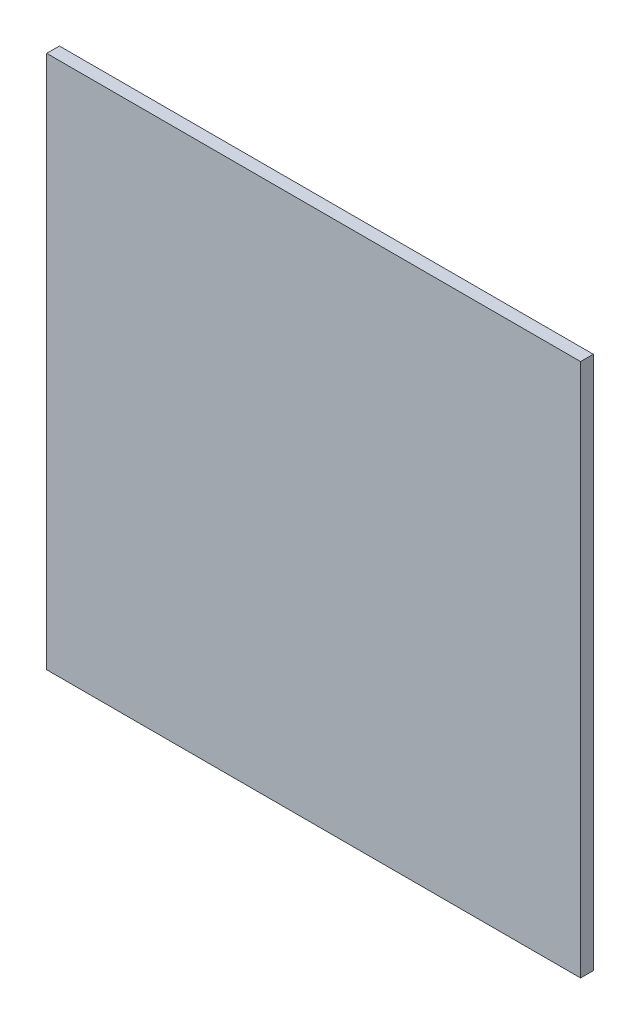
ISO-10303-21;
HEADER;
FILE_DESCRIPTION(('STEP AP214'),'2;1');
FILE_NAME('part.step','',(''),(''),'','','');
FILE_SCHEMA(('AUTOMOTIVE_DESIGN { 1 0 10303 214 1 1 1 1 }'));
ENDSEC;
DATA;
#1=APPLICATION_CONTEXT('core data for automotive mechanical design processes');
#2=APPLICATION_PROTOCOL_DEFINITION('international standard','automotive_design',2000,#1);
#3=PRODUCT_CONTEXT('',#1,'mechanical');
#4=PRODUCT('Part','Part','',(#3));
#5=PRODUCT_RELATED_PRODUCT_CATEGORY('part','',(#4));
#6=PRODUCT_DEFINITION_FORMATION('','',#4);
#7=PRODUCT_DEFINITION_CONTEXT('part definition',#1,'design');
#8=PRODUCT_DEFINITION('design','',#6,#7);
#9=PRODUCT_DEFINITION_SHAPE('','',#8);
#10=(LENGTH_UNIT() NAMED_UNIT(*) SI_UNIT(.MILLI.,.METRE.));
#11=(NAMED_UNIT(*) PLANE_ANGLE_UNIT() SI_UNIT($,.RADIAN.));
#12=(NAMED_UNIT(*) SI_UNIT($,.STERADIAN.) SOLID_ANGLE_UNIT());
#13=UNCERTAINTY_MEASURE_WITH_UNIT(LENGTH_MEASURE(1.E-05),#10,'distance_accuracy_value','');
#14=(GEOMETRIC_REPRESENTATION_CONTEXT(3) GLOBAL_UNCERTAINTY_ASSIGNED_CONTEXT((#13)) GLOBAL_UNIT_ASSIGNED_CONTEXT((#10,
#11,#12)) REPRESENTATION_CONTEXT('',''));
#15=CARTESIAN_POINT('',(0.,0.,0.));
#16=DIRECTION('',(0.,0.,1.));
#17=DIRECTION('',(1.,0.,0.));
#18=AXIS2_PLACEMENT_3D('',#15,#16,#17);
#19=CARTESIAN_POINT('',(133.35,-133.35,6.35));
#20=DIRECTION('',(-1.,0.,0.));
#21=DIRECTION('',(0.,0.,1.));
#22=AXIS2_PLACEMENT_3D('',#19,#20,#21);
#23=PLANE('',#22);
#24=DIRECTION('',(0.,1.,0.));
#25=VECTOR('',#24,1.);
#26=CARTESIAN_POINT('',(133.35,-133.35,0.));
#27=LINE('',#26,#25);
#28=CARTESIAN_POINT('',(133.35,-133.35,0.));
#29=VERTEX_POINT('',#28);
#30=CARTESIAN_POINT('',(133.35,133.35,0.));
#31=VERTEX_POINT('',#30);
#32=EDGE_CURVE('E102',#29,#31,#27,.T.);
#33=ORIENTED_EDGE('',*,*,#32,.T.);
#34=DIRECTION('',(0.,0.,-1.));
#35=VECTOR('',#34,1.);
#36=CARTESIAN_POINT('',(133.35,133.35,6.35));
#37=LINE('',#36,#35);
#38=CARTESIAN_POINT('',(133.35,133.35,6.35));
#39=VERTEX_POINT('',#38);
#40=EDGE_CURVE('E11',#39,#31,#37,.T.);
#41=ORIENTED_EDGE('',*,*,#40,.F.);
#42=DIRECTION('',(0.,1.,0.));
#43=VECTOR('',#42,1.);
#44=CARTESIAN_POINT('',(133.35,-133.35,6.35));
#45=LINE('',#44,#43);
#46=CARTESIAN_POINT('',(133.35,-133.35,6.35));
#47=VERTEX_POINT('',#46);
#48=EDGE_CURVE('E90',#47,#39,#45,.T.);
#49=ORIENTED_EDGE('',*,*,#48,.F.);
#50=DIRECTION('',(0.,0.,-1.));
#51=VECTOR('',#50,1.);
#52=CARTESIAN_POINT('',(133.35,-133.35,6.35));
#53=LINE('',#52,#51);
#54=EDGE_CURVE('E98',#47,#29,#53,.T.);
#55=ORIENTED_EDGE('',*,*,#54,.T.);
#56=EDGE_LOOP('',(#33,#41,#49,#55));
#57=FACE_BOUND('',#56,.T.);
#58=ADVANCED_FACE('F39',(#57),#23,.F.);
#59=CARTESIAN_POINT('',(-133.35,133.35,6.35));
#60=DIRECTION('',(0.,-1.,0.));
#61=DIRECTION('',(0.,0.,-1.));
#62=AXIS2_PLACEMENT_3D('',#59,#60,#61);
#63=PLANE('',#62);
#64=DIRECTION('',(-1.,0.,0.));
#65=VECTOR('',#64,1.);
#66=CARTESIAN_POINT('',(-133.35,133.35,0.));
#67=LINE('',#66,#65);
#68=CARTESIAN_POINT('',(-133.35,133.35,0.));
#69=VERTEX_POINT('',#68);
#70=EDGE_CURVE('E94',#31,#69,#67,.T.);
#71=ORIENTED_EDGE('',*,*,#70,.T.);
#72=DIRECTION('',(0.,0.,-1.));
#73=VECTOR('',#72,1.);
#74=CARTESIAN_POINT('',(-133.35,133.35,6.35));
#75=LINE('',#74,#73);
#76=CARTESIAN_POINT('',(-133.35,133.35,6.35));
#77=VERTEX_POINT('',#76);
#78=EDGE_CURVE('E47',#77,#69,#75,.T.);
#79=ORIENTED_EDGE('',*,*,#78,.F.);
#80=DIRECTION('',(-1.,0.,0.));
#81=VECTOR('',#80,1.);
#82=CARTESIAN_POINT('',(-133.35,133.35,6.35));
#83=LINE('',#82,#81);
#84=EDGE_CURVE('E85',#39,#77,#83,.T.);
#85=ORIENTED_EDGE('',*,*,#84,.F.);
#86=ORIENTED_EDGE('',*,*,#40,.T.);
#87=EDGE_LOOP('',(#71,#79,#85,#86));
#88=FACE_BOUND('',#87,.T.);
#89=ADVANCED_FACE('F93',(#88),#63,.F.);
#90=CARTESIAN_POINT('',(-133.35,-133.35,6.35));
#91=DIRECTION('',(1.,0.,0.));
#92=DIRECTION('',(0.,0.,-1.));
#93=AXIS2_PLACEMENT_3D('',#90,#91,#92);
#94=PLANE('',#93);
#95=DIRECTION('',(0.,-1.,0.));
#96=VECTOR('',#95,1.);
#97=CARTESIAN_POINT('',(-133.35,-133.35,0.));
#98=LINE('',#97,#96);
#99=CARTESIAN_POINT('',(-133.35,-133.35,0.));
#100=VERTEX_POINT('',#99);
#101=EDGE_CURVE('E72',#69,#100,#98,.T.);
#102=ORIENTED_EDGE('',*,*,#101,.T.);
#103=DIRECTION('',(0.,0.,-1.));
#104=VECTOR('',#103,1.);
#105=CARTESIAN_POINT('',(-133.35,-133.35,6.35));
#106=LINE('',#105,#104);
#107=CARTESIAN_POINT('',(-133.35,-133.35,6.35));
#108=VERTEX_POINT('',#107);
#109=EDGE_CURVE('E95',#108,#100,#106,.T.);
#110=ORIENTED_EDGE('',*,*,#109,.F.);
#111=DIRECTION('',(0.,-1.,0.));
#112=VECTOR('',#111,1.);
#113=CARTESIAN_POINT('',(-133.35,-133.35,6.35));
#114=LINE('',#113,#112);
#115=EDGE_CURVE('E88',#77,#108,#114,.T.);
#116=ORIENTED_EDGE('',*,*,#115,.F.);
#117=ORIENTED_EDGE('',*,*,#78,.T.);
#118=EDGE_LOOP('',(#102,#110,#116,#117));
#119=FACE_BOUND('',#118,.T.);
#120=ADVANCED_FACE('F96',(#119),#94,.F.);
#121=CARTESIAN_POINT('',(-133.35,-133.35,6.35));
#122=DIRECTION('',(0.,1.,0.));
#123=DIRECTION('',(0.,0.,1.));
#124=AXIS2_PLACEMENT_3D('',#121,#122,#123);
#125=PLANE('',#124);
#126=DIRECTION('',(1.,0.,0.));
#127=VECTOR('',#126,1.);
#128=CARTESIAN_POINT('',(-133.35,-133.35,0.));
#129=LINE('',#128,#127);
#130=EDGE_CURVE('E78',#100,#29,#129,.T.);
#131=ORIENTED_EDGE('',*,*,#130,.T.);
#132=ORIENTED_EDGE('',*,*,#54,.F.);
#133=DIRECTION('',(1.,0.,0.));
#134=VECTOR('',#133,1.);
#135=CARTESIAN_POINT('',(-133.35,-133.35,6.35));
#136=LINE('',#135,#134);
#137=EDGE_CURVE('E55',#108,#47,#136,.T.);
#138=ORIENTED_EDGE('',*,*,#137,.F.);
#139=ORIENTED_EDGE('',*,*,#109,.T.);
#140=EDGE_LOOP('',(#131,#132,#138,#139));
#141=FACE_BOUND('',#140,.T.);
#142=ADVANCED_FACE('F109',(#141),#125,.F.);
#143=CARTESIAN_POINT('',(0.,0.,6.35));
#144=DIRECTION('',(0.,0.,-1.));
#145=DIRECTION('',(-1.,0.,0.));
#146=AXIS2_PLACEMENT_3D('',#143,#144,#145);
#147=PLANE('',#146);
#148=ORIENTED_EDGE('',*,*,#48,.T.);
#149=ORIENTED_EDGE('',*,*,#84,.T.);
#150=ORIENTED_EDGE('',*,*,#115,.T.);
#151=ORIENTED_EDGE('',*,*,#137,.T.);
#152=EDGE_LOOP('',(#148,#149,#150,#151));
#153=FACE_BOUND('',#152,.T.);
#154=ADVANCED_FACE('F86',(#153),#147,.F.);
#155=CARTESIAN_POINT('',(0.,0.,0.));
#156=DIRECTION('',(0.,0.,-1.));
#157=DIRECTION('',(-1.,0.,0.));
#158=AXIS2_PLACEMENT_3D('',#155,#156,#157);
#159=PLANE('',#158);
#160=ORIENTED_EDGE('',*,*,#32,.F.);
#161=ORIENTED_EDGE('',*,*,#130,.F.);
#162=ORIENTED_EDGE('',*,*,#101,.F.);
#163=ORIENTED_EDGE('',*,*,#70,.F.);
#164=EDGE_LOOP('',(#160,#161,#162,#163));
#165=FACE_BOUND('',#164,.T.);
#166=ADVANCED_FACE('F112',(#165),#159,.T.);
#167=CLOSED_SHELL('',(#58,#89,#120,#142,#154,#166));
#168=MANIFOLD_SOLID_BREP('B2',#167);
#169=ADVANCED_BREP_SHAPE_REPRESENTATION('',(#18,#168),#14);
#170=SHAPE_DEFINITION_REPRESENTATION(#9,#169);
ENDSEC;
END-ISO-10303-21;
